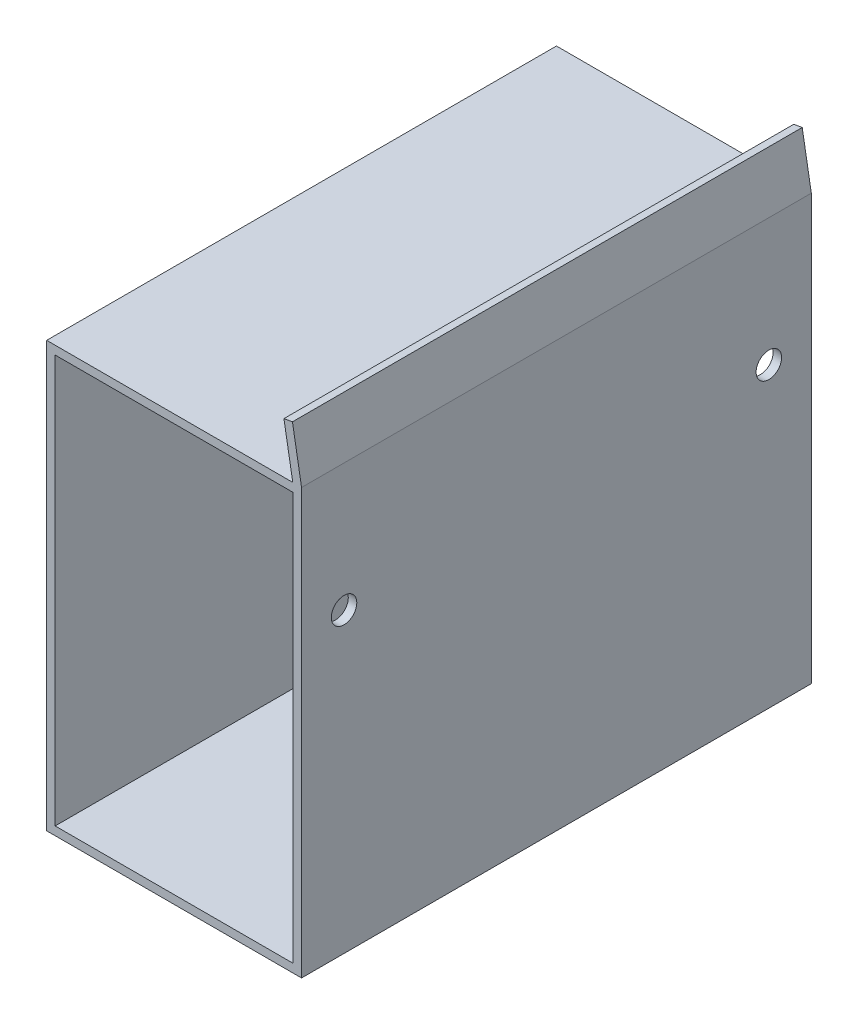
ISO-10303-21;
HEADER;
FILE_DESCRIPTION(('STEP AP214'),'2;1');
FILE_NAME('part.step','',(''),(''),'','','');
FILE_SCHEMA(('AUTOMOTIVE_DESIGN { 1 0 10303 214 1 1 1 1 }'));
ENDSEC;
DATA;
#1=APPLICATION_CONTEXT('core data for automotive mechanical design processes');
#2=APPLICATION_PROTOCOL_DEFINITION('international standard','automotive_design',2000,#1);
#3=PRODUCT_CONTEXT('',#1,'mechanical');
#4=PRODUCT('Part','Part','',(#3));
#5=PRODUCT_RELATED_PRODUCT_CATEGORY('part','',(#4));
#6=PRODUCT_DEFINITION_FORMATION('','',#4);
#7=PRODUCT_DEFINITION_CONTEXT('part definition',#1,'design');
#8=PRODUCT_DEFINITION('design','',#6,#7);
#9=PRODUCT_DEFINITION_SHAPE('','',#8);
#10=(LENGTH_UNIT() NAMED_UNIT(*) SI_UNIT(.MILLI.,.METRE.));
#11=(NAMED_UNIT(*) PLANE_ANGLE_UNIT() SI_UNIT($,.RADIAN.));
#12=(NAMED_UNIT(*) SI_UNIT($,.STERADIAN.) SOLID_ANGLE_UNIT());
#13=UNCERTAINTY_MEASURE_WITH_UNIT(LENGTH_MEASURE(1.E-05),#10,'distance_accuracy_value','');
#14=(GEOMETRIC_REPRESENTATION_CONTEXT(3) GLOBAL_UNCERTAINTY_ASSIGNED_CONTEXT((#13)) GLOBAL_UNIT_ASSIGNED_CONTEXT((#10,
#11,#12)) REPRESENTATION_CONTEXT('',''));
#15=CARTESIAN_POINT('',(0.,0.,0.));
#16=DIRECTION('',(0.,0.,1.));
#17=DIRECTION('',(1.,0.,0.));
#18=AXIS2_PLACEMENT_3D('',#15,#16,#17);
#19=CARTESIAN_POINT('',(0.,0.,60.));
#20=DIRECTION('',(0.,0.,1.));
#21=DIRECTION('',(1.,0.,0.));
#22=AXIS2_PLACEMENT_3D('',#19,#20,#21);
#23=PLANE('',#22);
#24=DIRECTION('',(0.,1.,0.));
#25=VECTOR('',#24,1.);
#26=CARTESIAN_POINT('',(0.,0.,60.));
#27=LINE('',#26,#25);
#28=CARTESIAN_POINT('',(0.,0.,60.));
#29=VERTEX_POINT('',#28);
#30=CARTESIAN_POINT('',(0.,50.,60.));
#31=VERTEX_POINT('',#30);
#32=EDGE_CURVE('E164',#29,#31,#27,.T.);
#33=ORIENTED_EDGE('',*,*,#32,.T.);
#34=DIRECTION('',(0.171394060209347,-0.985202555886329,0.));
#35=VECTOR('',#34,1.);
#36=CARTESIAN_POINT('',(0.,50.,60.));
#37=LINE('',#36,#35);
#38=CARTESIAN_POINT('',(-1.07129632194821,56.1579956341885,60.));
#39=VERTEX_POINT('',#38);
#40=EDGE_CURVE('E147',#39,#31,#37,.T.);
#41=ORIENTED_EDGE('',*,*,#40,.F.);
#42=DIRECTION('',(0.985202555886329,0.171394060209347,0.));
#43=VECTOR('',#42,1.);
#44=CARTESIAN_POINT('',(-1.07129632194821,56.1579956341885,60.));
#45=LINE('',#44,#43);
#46=CARTESIAN_POINT('',(-2.07531427209101,55.9833282909403,60.));
#47=VERTEX_POINT('',#46);
#48=EDGE_CURVE('E157',#47,#39,#45,.T.);
#49=ORIENTED_EDGE('',*,*,#48,.F.);
#50=DIRECTION('',(-0.171394060209347,0.985202555886329,0.));
#51=VECTOR('',#50,1.);
#52=CARTESIAN_POINT('',(-2.07531427209101,55.9833282909403,60.));
#53=LINE('',#52,#51);
#54=CARTESIAN_POINT('',(-1.03440453914059,50.,60.));
#55=VERTEX_POINT('',#54);
#56=EDGE_CURVE('E142',#55,#47,#53,.T.);
#57=ORIENTED_EDGE('',*,*,#56,.F.);
#58=DIRECTION('',(-1.,0.,0.));
#59=VECTOR('',#58,1.);
#60=CARTESIAN_POINT('',(0.,50.,60.));
#61=LINE('',#60,#59);
#62=CARTESIAN_POINT('',(-30.,50.,60.));
#63=VERTEX_POINT('',#62);
#64=EDGE_CURVE('E153',#55,#63,#61,.T.);
#65=ORIENTED_EDGE('',*,*,#64,.T.);
#66=DIRECTION('',(0.,-1.,0.));
#67=VECTOR('',#66,1.);
#68=CARTESIAN_POINT('',(-30.,0.,60.));
#69=LINE('',#68,#67);
#70=CARTESIAN_POINT('',(-30.,0.,60.));
#71=VERTEX_POINT('',#70);
#72=EDGE_CURVE('E163',#63,#71,#69,.T.);
#73=ORIENTED_EDGE('',*,*,#72,.T.);
#74=DIRECTION('',(1.,0.,0.));
#75=VECTOR('',#74,1.);
#76=CARTESIAN_POINT('',(0.,0.,60.));
#77=LINE('',#76,#75);
#78=EDGE_CURVE('E166',#71,#29,#77,.T.);
#79=ORIENTED_EDGE('',*,*,#78,.T.);
#80=EDGE_LOOP('',(#33,#41,#49,#57,#65,#73,#79));
#81=FACE_BOUND('',#80,.T.);
#82=DIRECTION('',(-1.,0.,0.));
#83=VECTOR('',#82,1.);
#84=CARTESIAN_POINT('',(0.,49.,60.));
#85=LINE('',#84,#83);
#86=CARTESIAN_POINT('',(-1.,49.,60.));
#87=VERTEX_POINT('',#86);
#88=CARTESIAN_POINT('',(-29.,49.,60.));
#89=VERTEX_POINT('',#88);
#90=EDGE_CURVE('E406',#87,#89,#85,.T.);
#91=ORIENTED_EDGE('',*,*,#90,.F.);
#92=DIRECTION('',(0.,1.,0.));
#93=VECTOR('',#92,1.);
#94=CARTESIAN_POINT('',(-1.,0.,60.));
#95=LINE('',#94,#93);
#96=CARTESIAN_POINT('',(-1.,1.,60.));
#97=VERTEX_POINT('',#96);
#98=EDGE_CURVE('E226',#97,#87,#95,.T.);
#99=ORIENTED_EDGE('',*,*,#98,.F.);
#100=DIRECTION('',(1.,0.,0.));
#101=VECTOR('',#100,1.);
#102=CARTESIAN_POINT('',(0.,1.,60.));
#103=LINE('',#102,#101);
#104=CARTESIAN_POINT('',(-29.,0.999999999999997,60.));
#105=VERTEX_POINT('',#104);
#106=EDGE_CURVE('E401',#105,#97,#103,.T.);
#107=ORIENTED_EDGE('',*,*,#106,.F.);
#108=DIRECTION('',(0.,-1.,0.));
#109=VECTOR('',#108,1.);
#110=CARTESIAN_POINT('',(-29.,0.,60.));
#111=LINE('',#110,#109);
#112=EDGE_CURVE('E417',#89,#105,#111,.T.);
#113=ORIENTED_EDGE('',*,*,#112,.F.);
#114=EDGE_LOOP('',(#91,#99,#107,#113));
#115=FACE_BOUND('',#114,.T.);
#116=ADVANCED_FACE('F57',(#81,#115),#23,.T.);
#117=CARTESIAN_POINT('',(0.,0.,0.));
#118=DIRECTION('',(0.,0.,1.));
#119=DIRECTION('',(1.,0.,0.));
#120=AXIS2_PLACEMENT_3D('',#117,#118,#119);
#121=PLANE('',#120);
#122=DIRECTION('',(0.,1.,0.));
#123=VECTOR('',#122,1.);
#124=CARTESIAN_POINT('',(0.,0.,0.));
#125=LINE('',#124,#123);
#126=CARTESIAN_POINT('',(0.,0.,0.));
#127=VERTEX_POINT('',#126);
#128=CARTESIAN_POINT('',(0.,50.,0.));
#129=VERTEX_POINT('',#128);
#130=EDGE_CURVE('E181',#127,#129,#125,.T.);
#131=ORIENTED_EDGE('',*,*,#130,.F.);
#132=DIRECTION('',(1.,0.,0.));
#133=VECTOR('',#132,1.);
#134=CARTESIAN_POINT('',(0.,0.,0.));
#135=LINE('',#134,#133);
#136=CARTESIAN_POINT('',(-30.,0.,0.));
#137=VERTEX_POINT('',#136);
#138=EDGE_CURVE('E168',#137,#127,#135,.T.);
#139=ORIENTED_EDGE('',*,*,#138,.F.);
#140=DIRECTION('',(0.,-1.,0.));
#141=VECTOR('',#140,1.);
#142=CARTESIAN_POINT('',(-30.,0.,0.));
#143=LINE('',#142,#141);
#144=CARTESIAN_POINT('',(-30.,50.,0.));
#145=VERTEX_POINT('',#144);
#146=EDGE_CURVE('E186',#145,#137,#143,.T.);
#147=ORIENTED_EDGE('',*,*,#146,.F.);
#148=DIRECTION('',(-1.,0.,0.));
#149=VECTOR('',#148,1.);
#150=CARTESIAN_POINT('',(0.,50.,0.));
#151=LINE('',#150,#149);
#152=CARTESIAN_POINT('',(-1.03440453914059,50.,0.));
#153=VERTEX_POINT('',#152);
#154=EDGE_CURVE('E173',#153,#145,#151,.T.);
#155=ORIENTED_EDGE('',*,*,#154,.F.);
#156=DIRECTION('',(-0.171394060209347,0.985202555886329,0.));
#157=VECTOR('',#156,1.);
#158=CARTESIAN_POINT('',(-2.07531427209101,55.9833282909403,0.));
#159=LINE('',#158,#157);
#160=CARTESIAN_POINT('',(-2.07531427209101,55.9833282909403,0.));
#161=VERTEX_POINT('',#160);
#162=EDGE_CURVE('E74',#153,#161,#159,.T.);
#163=ORIENTED_EDGE('',*,*,#162,.T.);
#164=DIRECTION('',(0.985202555886329,0.171394060209347,0.));
#165=VECTOR('',#164,1.);
#166=CARTESIAN_POINT('',(-1.07129632194821,56.1579956341885,0.));
#167=LINE('',#166,#165);
#168=CARTESIAN_POINT('',(-1.07129632194821,56.1579956341885,0.));
#169=VERTEX_POINT('',#168);
#170=EDGE_CURVE('E216',#161,#169,#167,.T.);
#171=ORIENTED_EDGE('',*,*,#170,.T.);
#172=DIRECTION('',(0.171394060209347,-0.985202555886329,0.));
#173=VECTOR('',#172,1.);
#174=CARTESIAN_POINT('',(0.,50.,0.));
#175=LINE('',#174,#173);
#176=EDGE_CURVE('E158',#169,#129,#175,.T.);
#177=ORIENTED_EDGE('',*,*,#176,.T.);
#178=EDGE_LOOP('',(#131,#139,#147,#155,#163,#171,#177));
#179=FACE_BOUND('',#178,.T.);
#180=DIRECTION('',(0.,1.,0.));
#181=VECTOR('',#180,1.);
#182=CARTESIAN_POINT('',(-1.,0.,0.));
#183=LINE('',#182,#181);
#184=CARTESIAN_POINT('',(-1.,1.,0.));
#185=VERTEX_POINT('',#184);
#186=CARTESIAN_POINT('',(-1.,49.,0.));
#187=VERTEX_POINT('',#186);
#188=EDGE_CURVE('E222',#185,#187,#183,.T.);
#189=ORIENTED_EDGE('',*,*,#188,.T.);
#190=DIRECTION('',(-1.,0.,0.));
#191=VECTOR('',#190,1.);
#192=CARTESIAN_POINT('',(0.,49.,0.));
#193=LINE('',#192,#191);
#194=CARTESIAN_POINT('',(-29.,49.,0.));
#195=VERTEX_POINT('',#194);
#196=EDGE_CURVE('E396',#187,#195,#193,.T.);
#197=ORIENTED_EDGE('',*,*,#196,.T.);
#198=DIRECTION('',(0.,-1.,0.));
#199=VECTOR('',#198,1.);
#200=CARTESIAN_POINT('',(-29.,0.,0.));
#201=LINE('',#200,#199);
#202=CARTESIAN_POINT('',(-29.,0.999999999999997,0.));
#203=VERTEX_POINT('',#202);
#204=EDGE_CURVE('E404',#195,#203,#201,.T.);
#205=ORIENTED_EDGE('',*,*,#204,.T.);
#206=DIRECTION('',(1.,0.,0.));
#207=VECTOR('',#206,1.);
#208=CARTESIAN_POINT('',(0.,1.,0.));
#209=LINE('',#208,#207);
#210=EDGE_CURVE('E398',#203,#185,#209,.T.);
#211=ORIENTED_EDGE('',*,*,#210,.T.);
#212=EDGE_LOOP('',(#189,#197,#205,#211));
#213=FACE_BOUND('',#212,.T.);
#214=ADVANCED_FACE('F201',(#179,#213),#121,.F.);
#215=CARTESIAN_POINT('',(0.,0.,60.));
#216=DIRECTION('',(-1.,0.,0.));
#217=DIRECTION('',(0.,0.,1.));
#218=AXIS2_PLACEMENT_3D('',#215,#216,#217);
#219=PLANE('',#218);
#220=CARTESIAN_POINT('',(0.,35.,5.));
#221=DIRECTION('',(1.,0.,0.));
#222=DIRECTION('',(0.,0.,-1.));
#223=AXIS2_PLACEMENT_3D('',#220,#221,#222);
#224=CIRCLE('',#223,1.5);
#225=CARTESIAN_POINT('',(0.,35.,3.5));
#226=VERTEX_POINT('',#225);
#227=EDGE_CURVE('E240',#226,#226,#224,.T.);
#228=ORIENTED_EDGE('',*,*,#227,.F.);
#229=EDGE_LOOP('',(#228));
#230=FACE_BOUND('',#229,.T.);
#231=CARTESIAN_POINT('',(0.,35.,55.));
#232=DIRECTION('',(1.,0.,0.));
#233=DIRECTION('',(0.,0.,-1.));
#234=AXIS2_PLACEMENT_3D('',#231,#232,#233);
#235=CIRCLE('',#234,1.5);
#236=CARTESIAN_POINT('',(0.,35.,53.5));
#237=VERTEX_POINT('',#236);
#238=EDGE_CURVE('E233',#237,#237,#235,.T.);
#239=ORIENTED_EDGE('',*,*,#238,.F.);
#240=EDGE_LOOP('',(#239));
#241=FACE_BOUND('',#240,.T.);
#242=ORIENTED_EDGE('',*,*,#130,.T.);
#243=DIRECTION('',(0.,0.,-1.));
#244=VECTOR('',#243,1.);
#245=CARTESIAN_POINT('',(0.,50.,60.));
#246=LINE('',#245,#244);
#247=EDGE_CURVE('E12',#31,#129,#246,.T.);
#248=ORIENTED_EDGE('',*,*,#247,.F.);
#249=ORIENTED_EDGE('',*,*,#32,.F.);
#250=DIRECTION('',(0.,0.,-1.));
#251=VECTOR('',#250,1.);
#252=CARTESIAN_POINT('',(0.,0.,60.));
#253=LINE('',#252,#251);
#254=EDGE_CURVE('E180',#29,#127,#253,.T.);
#255=ORIENTED_EDGE('',*,*,#254,.T.);
#256=EDGE_LOOP('',(#242,#248,#249,#255));
#257=FACE_BOUND('',#256,.T.);
#258=ADVANCED_FACE('F59',(#230,#241,#257),#219,.F.);
#259=CARTESIAN_POINT('',(0.,50.,60.));
#260=DIRECTION('',(0.,-1.,0.));
#261=DIRECTION('',(1.,0.,0.));
#262=AXIS2_PLACEMENT_3D('',#259,#260,#261);
#263=PLANE('',#262);
#264=ORIENTED_EDGE('',*,*,#64,.F.);
#265=DIRECTION('',(0.,0.,-1.));
#266=VECTOR('',#265,1.);
#267=CARTESIAN_POINT('',(-1.03440453914059,50.,60.));
#268=LINE('',#267,#266);
#269=EDGE_CURVE('E139',#55,#153,#268,.T.);
#270=ORIENTED_EDGE('',*,*,#269,.T.);
#271=ORIENTED_EDGE('',*,*,#154,.T.);
#272=DIRECTION('',(0.,0.,-1.));
#273=VECTOR('',#272,1.);
#274=CARTESIAN_POINT('',(-30.,50.,60.));
#275=LINE('',#274,#273);
#276=EDGE_CURVE('E66',#63,#145,#275,.T.);
#277=ORIENTED_EDGE('',*,*,#276,.F.);
#278=EDGE_LOOP('',(#264,#270,#271,#277));
#279=FACE_BOUND('',#278,.T.);
#280=ADVANCED_FACE('F160',(#279),#263,.F.);
#281=CARTESIAN_POINT('',(-30.,0.,60.));
#282=DIRECTION('',(1.,0.,0.));
#283=DIRECTION('',(0.,0.,-1.));
#284=AXIS2_PLACEMENT_3D('',#281,#282,#283);
#285=PLANE('',#284);
#286=ORIENTED_EDGE('',*,*,#146,.T.);
#287=DIRECTION('',(0.,0.,-1.));
#288=VECTOR('',#287,1.);
#289=CARTESIAN_POINT('',(-30.,0.,60.));
#290=LINE('',#289,#288);
#291=EDGE_CURVE('E191',#71,#137,#290,.T.);
#292=ORIENTED_EDGE('',*,*,#291,.F.);
#293=ORIENTED_EDGE('',*,*,#72,.F.);
#294=ORIENTED_EDGE('',*,*,#276,.T.);
#295=EDGE_LOOP('',(#286,#292,#293,#294));
#296=FACE_BOUND('',#295,.T.);
#297=ADVANCED_FACE('F196',(#296),#285,.F.);
#298=CARTESIAN_POINT('',(0.,0.,60.));
#299=DIRECTION('',(0.,1.,0.));
#300=DIRECTION('',(-1.,0.,0.));
#301=AXIS2_PLACEMENT_3D('',#298,#299,#300);
#302=PLANE('',#301);
#303=ORIENTED_EDGE('',*,*,#138,.T.);
#304=ORIENTED_EDGE('',*,*,#254,.F.);
#305=ORIENTED_EDGE('',*,*,#78,.F.);
#306=ORIENTED_EDGE('',*,*,#291,.T.);
#307=EDGE_LOOP('',(#303,#304,#305,#306));
#308=FACE_BOUND('',#307,.T.);
#309=ADVANCED_FACE('F206',(#308),#302,.F.);
#310=CARTESIAN_POINT('',(-1.,0.,60.));
#311=DIRECTION('',(-1.,0.,0.));
#312=DIRECTION('',(0.,0.,1.));
#313=AXIS2_PLACEMENT_3D('',#310,#311,#312);
#314=PLANE('',#313);
#315=CARTESIAN_POINT('',(-0.999999999999999,35.,5.));
#316=DIRECTION('',(-1.,0.,0.));
#317=DIRECTION('',(0.,0.,1.));
#318=AXIS2_PLACEMENT_3D('',#315,#316,#317);
#319=CIRCLE('',#318,1.5);
#320=CARTESIAN_POINT('',(-0.999999999999999,35.,6.50000000000001));
#321=VERTEX_POINT('',#320);
#322=EDGE_CURVE('E61',#321,#321,#319,.T.);
#323=ORIENTED_EDGE('',*,*,#322,.F.);
#324=EDGE_LOOP('',(#323));
#325=FACE_BOUND('',#324,.T.);
#326=CARTESIAN_POINT('',(-0.999999999999999,35.,55.));
#327=DIRECTION('',(-1.,0.,0.));
#328=DIRECTION('',(0.,0.,1.));
#329=AXIS2_PLACEMENT_3D('',#326,#327,#328);
#330=CIRCLE('',#329,1.5);
#331=CARTESIAN_POINT('',(-0.999999999999999,35.,56.5));
#332=VERTEX_POINT('',#331);
#333=EDGE_CURVE('E231',#332,#332,#330,.T.);
#334=ORIENTED_EDGE('',*,*,#333,.F.);
#335=EDGE_LOOP('',(#334));
#336=FACE_BOUND('',#335,.T.);
#337=ORIENTED_EDGE('',*,*,#188,.F.);
#338=DIRECTION('',(0.,0.,-1.));
#339=VECTOR('',#338,1.);
#340=CARTESIAN_POINT('',(-1.,1.,60.));
#341=LINE('',#340,#339);
#342=EDGE_CURVE('E391',#97,#185,#341,.T.);
#343=ORIENTED_EDGE('',*,*,#342,.F.);
#344=ORIENTED_EDGE('',*,*,#98,.T.);
#345=DIRECTION('',(0.,0.,-1.));
#346=VECTOR('',#345,1.);
#347=CARTESIAN_POINT('',(-1.,49.,60.));
#348=LINE('',#347,#346);
#349=EDGE_CURVE('E183',#87,#187,#348,.T.);
#350=ORIENTED_EDGE('',*,*,#349,.T.);
#351=EDGE_LOOP('',(#337,#343,#344,#350));
#352=FACE_BOUND('',#351,.T.);
#353=ADVANCED_FACE('F261',(#325,#336,#352),#314,.T.);
#354=CARTESIAN_POINT('',(0.,49.,60.));
#355=DIRECTION('',(0.,-1.,0.));
#356=DIRECTION('',(1.,0.,0.));
#357=AXIS2_PLACEMENT_3D('',#354,#355,#356);
#358=PLANE('',#357);
#359=ORIENTED_EDGE('',*,*,#196,.F.);
#360=ORIENTED_EDGE('',*,*,#349,.F.);
#361=ORIENTED_EDGE('',*,*,#90,.T.);
#362=DIRECTION('',(0.,0.,-1.));
#363=VECTOR('',#362,1.);
#364=CARTESIAN_POINT('',(-29.,49.,60.));
#365=LINE('',#364,#363);
#366=EDGE_CURVE('E411',#89,#195,#365,.T.);
#367=ORIENTED_EDGE('',*,*,#366,.T.);
#368=EDGE_LOOP('',(#359,#360,#361,#367));
#369=FACE_BOUND('',#368,.T.);
#370=ADVANCED_FACE('F282',(#369),#358,.T.);
#371=CARTESIAN_POINT('',(-29.,0.,60.));
#372=DIRECTION('',(1.,0.,0.));
#373=DIRECTION('',(0.,0.,-1.));
#374=AXIS2_PLACEMENT_3D('',#371,#372,#373);
#375=PLANE('',#374);
#376=ORIENTED_EDGE('',*,*,#204,.F.);
#377=ORIENTED_EDGE('',*,*,#366,.F.);
#378=ORIENTED_EDGE('',*,*,#112,.T.);
#379=DIRECTION('',(0.,0.,-1.));
#380=VECTOR('',#379,1.);
#381=CARTESIAN_POINT('',(-29.,0.999999999999997,60.));
#382=LINE('',#381,#380);
#383=EDGE_CURVE('E82',#105,#203,#382,.T.);
#384=ORIENTED_EDGE('',*,*,#383,.T.);
#385=EDGE_LOOP('',(#376,#377,#378,#384));
#386=FACE_BOUND('',#385,.T.);
#387=ADVANCED_FACE('F291',(#386),#375,.T.);
#388=CARTESIAN_POINT('',(0.,1.,60.));
#389=DIRECTION('',(0.,1.,0.));
#390=DIRECTION('',(-1.,0.,0.));
#391=AXIS2_PLACEMENT_3D('',#388,#389,#390);
#392=PLANE('',#391);
#393=ORIENTED_EDGE('',*,*,#210,.F.);
#394=ORIENTED_EDGE('',*,*,#383,.F.);
#395=ORIENTED_EDGE('',*,*,#106,.T.);
#396=ORIENTED_EDGE('',*,*,#342,.T.);
#397=EDGE_LOOP('',(#393,#394,#395,#396));
#398=FACE_BOUND('',#397,.T.);
#399=ADVANCED_FACE('F297',(#398),#392,.T.);
#400=CARTESIAN_POINT('',(0.,50.,60.));
#401=DIRECTION('',(0.985202555886329,0.171394060209347,0.));
#402=DIRECTION('',(-0.171394060209347,0.985202555886329,0.));
#403=AXIS2_PLACEMENT_3D('',#400,#401,#402);
#404=PLANE('',#403);
#405=ORIENTED_EDGE('',*,*,#176,.F.);
#406=DIRECTION('',(0.,0.,-1.));
#407=VECTOR('',#406,1.);
#408=CARTESIAN_POINT('',(-1.07129632194821,56.1579956341885,60.));
#409=LINE('',#408,#407);
#410=EDGE_CURVE('E220',#39,#169,#409,.T.);
#411=ORIENTED_EDGE('',*,*,#410,.F.);
#412=ORIENTED_EDGE('',*,*,#40,.T.);
#413=ORIENTED_EDGE('',*,*,#247,.T.);
#414=EDGE_LOOP('',(#405,#411,#412,#413));
#415=FACE_BOUND('',#414,.T.);
#416=ADVANCED_FACE('F305',(#415),#404,.T.);
#417=CARTESIAN_POINT('',(-1.07129632194821,56.1579956341885,60.));
#418=DIRECTION('',(-0.171394060209347,0.985202555886329,0.));
#419=DIRECTION('',(-0.985202555886329,-0.171394060209347,0.));
#420=AXIS2_PLACEMENT_3D('',#417,#418,#419);
#421=PLANE('',#420);
#422=ORIENTED_EDGE('',*,*,#170,.F.);
#423=DIRECTION('',(0.,0.,-1.));
#424=VECTOR('',#423,1.);
#425=CARTESIAN_POINT('',(-2.07531427209101,55.9833282909403,60.));
#426=LINE('',#425,#424);
#427=EDGE_CURVE('E146',#47,#161,#426,.T.);
#428=ORIENTED_EDGE('',*,*,#427,.F.);
#429=ORIENTED_EDGE('',*,*,#48,.T.);
#430=ORIENTED_EDGE('',*,*,#410,.T.);
#431=EDGE_LOOP('',(#422,#428,#429,#430));
#432=FACE_BOUND('',#431,.T.);
#433=ADVANCED_FACE('F312',(#432),#421,.T.);
#434=CARTESIAN_POINT('',(-2.07531427209101,55.9833282909403,60.));
#435=DIRECTION('',(-0.985202555886329,-0.171394060209347,0.));
#436=DIRECTION('',(0.171394060209347,-0.985202555886329,0.));
#437=AXIS2_PLACEMENT_3D('',#434,#435,#436);
#438=PLANE('',#437);
#439=ORIENTED_EDGE('',*,*,#162,.F.);
#440=ORIENTED_EDGE('',*,*,#269,.F.);
#441=ORIENTED_EDGE('',*,*,#56,.T.);
#442=ORIENTED_EDGE('',*,*,#427,.T.);
#443=EDGE_LOOP('',(#439,#440,#441,#442));
#444=FACE_BOUND('',#443,.T.);
#445=ADVANCED_FACE('F141',(#444),#438,.T.);
#446=CARTESIAN_POINT('',(-10.,35.,55.));
#447=DIRECTION('',(1.,0.,0.));
#448=DIRECTION('',(0.,0.,-1.));
#449=AXIS2_PLACEMENT_3D('',#446,#447,#448);
#450=CYLINDRICAL_SURFACE('',#449,1.5);
#451=ORIENTED_EDGE('',*,*,#333,.T.);
#452=EDGE_LOOP('',(#451));
#453=FACE_BOUND('',#452,.T.);
#454=ORIENTED_EDGE('',*,*,#238,.T.);
#455=EDGE_LOOP('',(#454));
#456=FACE_BOUND('',#455,.T.);
#457=ADVANCED_FACE('F325',(#453,#456),#450,.F.);
#458=CARTESIAN_POINT('',(-10.,35.,5.));
#459=DIRECTION('',(1.,0.,0.));
#460=DIRECTION('',(0.,0.,-1.));
#461=AXIS2_PLACEMENT_3D('',#458,#459,#460);
#462=CYLINDRICAL_SURFACE('',#461,1.5);
#463=ORIENTED_EDGE('',*,*,#322,.T.);
#464=EDGE_LOOP('',(#463));
#465=FACE_BOUND('',#464,.T.);
#466=ORIENTED_EDGE('',*,*,#227,.T.);
#467=EDGE_LOOP('',(#466));
#468=FACE_BOUND('',#467,.T.);
#469=ADVANCED_FACE('F245',(#465,#468),#462,.F.);
#470=CLOSED_SHELL('',(#116,#214,#258,#280,#297,#309,#353,#370,#387,#399,#416,#433,#445,#457,#469));
#471=MANIFOLD_SOLID_BREP('B2',#470);
#472=ADVANCED_BREP_SHAPE_REPRESENTATION('',(#18,#471),#14);
#473=SHAPE_DEFINITION_REPRESENTATION(#9,#472);
ENDSEC;
END-ISO-10303-21;
